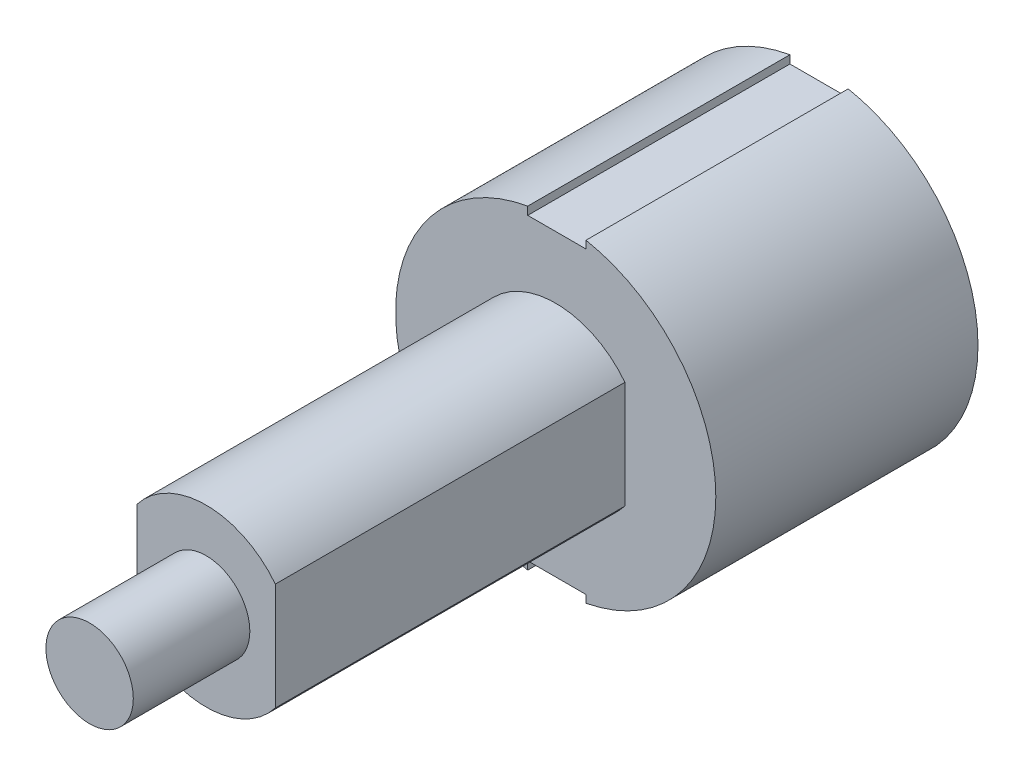
ISO-10303-21;
HEADER;
FILE_DESCRIPTION(('STEP AP214'),'2;1');
FILE_NAME('part.step','',(''),(''),'','','');
FILE_SCHEMA(('AUTOMOTIVE_DESIGN { 1 0 10303 214 1 1 1 1 }'));
ENDSEC;
DATA;
#1=APPLICATION_CONTEXT('core data for automotive mechanical design processes');
#2=APPLICATION_PROTOCOL_DEFINITION('international standard','automotive_design',2000,#1);
#3=PRODUCT_CONTEXT('',#1,'mechanical');
#4=PRODUCT('Part','Part','',(#3));
#5=PRODUCT_RELATED_PRODUCT_CATEGORY('part','',(#4));
#6=PRODUCT_DEFINITION_FORMATION('','',#4);
#7=PRODUCT_DEFINITION_CONTEXT('part definition',#1,'design');
#8=PRODUCT_DEFINITION('design','',#6,#7);
#9=PRODUCT_DEFINITION_SHAPE('','',#8);
#10=(LENGTH_UNIT() NAMED_UNIT(*) SI_UNIT(.MILLI.,.METRE.));
#11=(NAMED_UNIT(*) PLANE_ANGLE_UNIT() SI_UNIT($,.RADIAN.));
#12=(NAMED_UNIT(*) SI_UNIT($,.STERADIAN.) SOLID_ANGLE_UNIT());
#13=UNCERTAINTY_MEASURE_WITH_UNIT(LENGTH_MEASURE(1.E-05),#10,'distance_accuracy_value','');
#14=(GEOMETRIC_REPRESENTATION_CONTEXT(3) GLOBAL_UNCERTAINTY_ASSIGNED_CONTEXT((#13)) GLOBAL_UNIT_ASSIGNED_CONTEXT((#10,
#11,#12)) REPRESENTATION_CONTEXT('',''));
#15=CARTESIAN_POINT('',(0.,0.,0.));
#16=DIRECTION('',(0.,0.,1.));
#17=DIRECTION('',(1.,0.,0.));
#18=AXIS2_PLACEMENT_3D('',#15,#16,#17);
#19=CARTESIAN_POINT('',(1.65099999999998,0.,14.2875));
#20=DIRECTION('',(-1.,0.,0.));
#21=DIRECTION('',(0.,-1.,0.));
#22=AXIS2_PLACEMENT_3D('',#19,#20,#21);
#23=PLANE('',#22);
#24=DIRECTION('',(0.,1.,0.));
#25=VECTOR('',#24,1.);
#26=CARTESIAN_POINT('',(1.65099999999998,0.,0.));
#27=LINE('',#26,#25);
#28=CARTESIAN_POINT('',(1.651,-8.56726788480435,0.));
#29=VERTEX_POINT('',#28);
#30=CARTESIAN_POINT('',(1.651,-8.15270585446612,0.));
#31=VERTEX_POINT('',#30);
#32=EDGE_CURVE('E183',#29,#31,#27,.T.);
#33=ORIENTED_EDGE('',*,*,#32,.F.);
#34=DIRECTION('',(0.,0.,-1.));
#35=VECTOR('',#34,1.);
#36=CARTESIAN_POINT('',(1.651,-8.56726788480435,14.2875));
#37=LINE('',#36,#35);
#38=CARTESIAN_POINT('',(1.651,-8.56726788480435,14.2875));
#39=VERTEX_POINT('',#38);
#40=EDGE_CURVE('E11',#39,#29,#37,.T.);
#41=ORIENTED_EDGE('',*,*,#40,.F.);
#42=DIRECTION('',(0.,1.,0.));
#43=VECTOR('',#42,1.);
#44=CARTESIAN_POINT('',(1.65099999999998,0.,14.2875));
#45=LINE('',#44,#43);
#46=CARTESIAN_POINT('',(1.651,-8.15270585446612,14.2875));
#47=VERTEX_POINT('',#46);
#48=EDGE_CURVE('E219',#39,#47,#45,.T.);
#49=ORIENTED_EDGE('',*,*,#48,.T.);
#50=DIRECTION('',(0.,0.,-1.));
#51=VECTOR('',#50,1.);
#52=CARTESIAN_POINT('',(1.651,-8.15270585446612,14.2875));
#53=LINE('',#52,#51);
#54=EDGE_CURVE('E93',#47,#31,#53,.T.);
#55=ORIENTED_EDGE('',*,*,#54,.T.);
#56=EDGE_LOOP('',(#33,#41,#49,#55));
#57=FACE_BOUND('',#56,.T.);
#58=ADVANCED_FACE('F41',(#57),#23,.T.);
#59=CARTESIAN_POINT('',(0.,0.,14.2875));
#60=DIRECTION('',(0.,0.,-1.));
#61=DIRECTION('',(-1.,0.,0.));
#62=AXIS2_PLACEMENT_3D('',#59,#60,#61);
#63=CYLINDRICAL_SURFACE('',#62,8.7249);
#64=CARTESIAN_POINT('',(0.,0.,0.));
#65=DIRECTION('',(0.,0.,1.));
#66=DIRECTION('',(1.,0.,0.));
#67=AXIS2_PLACEMENT_3D('',#64,#65,#66);
#68=CIRCLE('',#67,8.7249);
#69=CARTESIAN_POINT('',(1.651,8.56726788480435,0.));
#70=VERTEX_POINT('',#69);
#71=EDGE_CURVE('E180',#29,#70,#68,.T.);
#72=ORIENTED_EDGE('',*,*,#71,.T.);
#73=DIRECTION('',(0.,0.,-1.));
#74=VECTOR('',#73,1.);
#75=CARTESIAN_POINT('',(1.651,8.56726788480435,14.2875));
#76=LINE('',#75,#74);
#77=CARTESIAN_POINT('',(1.651,8.56726788480435,14.2875));
#78=VERTEX_POINT('',#77);
#79=EDGE_CURVE('E50',#78,#70,#76,.T.);
#80=ORIENTED_EDGE('',*,*,#79,.F.);
#81=CARTESIAN_POINT('',(0.,0.,14.2875));
#82=DIRECTION('',(0.,0.,1.));
#83=DIRECTION('',(1.,0.,0.));
#84=AXIS2_PLACEMENT_3D('',#81,#82,#83);
#85=CIRCLE('',#84,8.7249);
#86=EDGE_CURVE('E216',#39,#78,#85,.T.);
#87=ORIENTED_EDGE('',*,*,#86,.F.);
#88=ORIENTED_EDGE('',*,*,#40,.T.);
#89=EDGE_LOOP('',(#72,#80,#87,#88));
#90=FACE_BOUND('',#89,.T.);
#91=ADVANCED_FACE('F181',(#90),#63,.T.);
#92=CARTESIAN_POINT('',(1.651,0.,14.2875));
#93=DIRECTION('',(1.,0.,0.));
#94=DIRECTION('',(0.,0.,-1.));
#95=AXIS2_PLACEMENT_3D('',#92,#93,#94);
#96=PLANE('',#95);
#97=DIRECTION('',(0.,-1.,0.));
#98=VECTOR('',#97,1.);
#99=CARTESIAN_POINT('',(1.651,0.,0.));
#100=LINE('',#99,#98);
#101=CARTESIAN_POINT('',(1.651,8.15270585446612,0.));
#102=VERTEX_POINT('',#101);
#103=EDGE_CURVE('E173',#70,#102,#100,.T.);
#104=ORIENTED_EDGE('',*,*,#103,.T.);
#105=DIRECTION('',(0.,0.,-1.));
#106=VECTOR('',#105,1.);
#107=CARTESIAN_POINT('',(1.651,8.15270585446612,14.2875));
#108=LINE('',#107,#106);
#109=CARTESIAN_POINT('',(1.651,8.15270585446612,14.2875));
#110=VERTEX_POINT('',#109);
#111=EDGE_CURVE('E163',#110,#102,#108,.T.);
#112=ORIENTED_EDGE('',*,*,#111,.F.);
#113=DIRECTION('',(0.,-1.,0.));
#114=VECTOR('',#113,1.);
#115=CARTESIAN_POINT('',(1.651,0.,14.2875));
#116=LINE('',#115,#114);
#117=EDGE_CURVE('E175',#78,#110,#116,.T.);
#118=ORIENTED_EDGE('',*,*,#117,.F.);
#119=ORIENTED_EDGE('',*,*,#79,.T.);
#120=EDGE_LOOP('',(#104,#112,#118,#119));
#121=FACE_BOUND('',#120,.T.);
#122=ADVANCED_FACE('F171',(#121),#96,.F.);
#123=CARTESIAN_POINT('',(0.,8.15270585446612,14.2875));
#124=DIRECTION('',(0.,1.,0.));
#125=DIRECTION('',(0.,0.,1.));
#126=AXIS2_PLACEMENT_3D('',#123,#124,#125);
#127=PLANE('',#126);
#128=DIRECTION('',(1.,0.,0.));
#129=VECTOR('',#128,1.);
#130=CARTESIAN_POINT('',(0.,8.15270585446612,0.));
#131=LINE('',#130,#129);
#132=CARTESIAN_POINT('',(-1.524,8.15270585446612,0.));
#133=VERTEX_POINT('',#132);
#134=EDGE_CURVE('E187',#133,#102,#131,.T.);
#135=ORIENTED_EDGE('',*,*,#134,.F.);
#136=DIRECTION('',(0.,0.,-1.));
#137=VECTOR('',#136,1.);
#138=CARTESIAN_POINT('',(-1.524,8.15270585446612,14.2875));
#139=LINE('',#138,#137);
#140=CARTESIAN_POINT('',(-1.524,8.15270585446612,14.2875));
#141=VERTEX_POINT('',#140);
#142=EDGE_CURVE('E156',#141,#133,#139,.T.);
#143=ORIENTED_EDGE('',*,*,#142,.F.);
#144=DIRECTION('',(1.,0.,0.));
#145=VECTOR('',#144,1.);
#146=CARTESIAN_POINT('',(0.,8.15270585446612,14.2875));
#147=LINE('',#146,#145);
#148=EDGE_CURVE('E210',#141,#110,#147,.T.);
#149=ORIENTED_EDGE('',*,*,#148,.T.);
#150=ORIENTED_EDGE('',*,*,#111,.T.);
#151=EDGE_LOOP('',(#135,#143,#149,#150));
#152=FACE_BOUND('',#151,.T.);
#153=ADVANCED_FACE('F314',(#152),#127,.T.);
#154=CARTESIAN_POINT('',(-1.524,0.,14.2875));
#155=DIRECTION('',(1.,0.,0.));
#156=DIRECTION('',(0.,0.,-1.));
#157=AXIS2_PLACEMENT_3D('',#154,#155,#156);
#158=PLANE('',#157);
#159=DIRECTION('',(0.,-1.,0.));
#160=VECTOR('',#159,1.);
#161=CARTESIAN_POINT('',(-1.524,0.,0.));
#162=LINE('',#161,#160);
#163=CARTESIAN_POINT('',(-1.524,8.59076853430472,0.));
#164=VERTEX_POINT('',#163);
#165=EDGE_CURVE('E195',#164,#133,#162,.T.);
#166=ORIENTED_EDGE('',*,*,#165,.F.);
#167=DIRECTION('',(0.,0.,-1.));
#168=VECTOR('',#167,1.);
#169=CARTESIAN_POINT('',(-1.524,8.59076853430472,14.2875));
#170=LINE('',#169,#168);
#171=CARTESIAN_POINT('',(-1.524,8.59076853430472,14.2875));
#172=VERTEX_POINT('',#171);
#173=EDGE_CURVE('E152',#172,#164,#170,.T.);
#174=ORIENTED_EDGE('',*,*,#173,.F.);
#175=DIRECTION('',(0.,-1.,0.));
#176=VECTOR('',#175,1.);
#177=CARTESIAN_POINT('',(-1.524,0.,14.2875));
#178=LINE('',#177,#176);
#179=EDGE_CURVE('E144',#172,#141,#178,.T.);
#180=ORIENTED_EDGE('',*,*,#179,.T.);
#181=ORIENTED_EDGE('',*,*,#142,.T.);
#182=EDGE_LOOP('',(#166,#174,#180,#181));
#183=FACE_BOUND('',#182,.T.);
#184=ADVANCED_FACE('F311',(#183),#158,.T.);
#185=CARTESIAN_POINT('',(0.,0.,14.2875));
#186=DIRECTION('',(0.,0.,-1.));
#187=DIRECTION('',(-1.,0.,0.));
#188=AXIS2_PLACEMENT_3D('',#185,#186,#187);
#189=CYLINDRICAL_SURFACE('',#188,8.7249);
#190=CARTESIAN_POINT('',(0.,0.,0.));
#191=DIRECTION('',(0.,0.,1.));
#192=DIRECTION('',(1.,0.,0.));
#193=AXIS2_PLACEMENT_3D('',#190,#191,#192);
#194=CIRCLE('',#193,8.7249);
#195=CARTESIAN_POINT('',(-1.524,-8.59076853430472,0.));
#196=VERTEX_POINT('',#195);
#197=EDGE_CURVE('E150',#164,#196,#194,.T.);
#198=ORIENTED_EDGE('',*,*,#197,.T.);
#199=DIRECTION('',(0.,0.,-1.));
#200=VECTOR('',#199,1.);
#201=CARTESIAN_POINT('',(-1.524,-8.59076853430472,14.2875));
#202=LINE('',#201,#200);
#203=CARTESIAN_POINT('',(-1.524,-8.59076853430472,14.2875));
#204=VERTEX_POINT('',#203);
#205=EDGE_CURVE('E133',#204,#196,#202,.T.);
#206=ORIENTED_EDGE('',*,*,#205,.F.);
#207=CARTESIAN_POINT('',(0.,0.,14.2875));
#208=DIRECTION('',(0.,0.,1.));
#209=DIRECTION('',(1.,0.,0.));
#210=AXIS2_PLACEMENT_3D('',#207,#208,#209);
#211=CIRCLE('',#210,8.7249);
#212=EDGE_CURVE('E137',#172,#204,#211,.T.);
#213=ORIENTED_EDGE('',*,*,#212,.F.);
#214=ORIENTED_EDGE('',*,*,#173,.T.);
#215=EDGE_LOOP('',(#198,#206,#213,#214));
#216=FACE_BOUND('',#215,.T.);
#217=ADVANCED_FACE('F148',(#216),#189,.T.);
#218=CARTESIAN_POINT('',(-1.52399999999998,0.,14.2875));
#219=DIRECTION('',(-1.,0.,0.));
#220=DIRECTION('',(0.,-1.,0.));
#221=AXIS2_PLACEMENT_3D('',#218,#219,#220);
#222=PLANE('',#221);
#223=DIRECTION('',(0.,1.,0.));
#224=VECTOR('',#223,1.);
#225=CARTESIAN_POINT('',(-1.52399999999998,0.,0.));
#226=LINE('',#225,#224);
#227=CARTESIAN_POINT('',(-1.524,-8.15270585446612,0.));
#228=VERTEX_POINT('',#227);
#229=EDGE_CURVE('E201',#196,#228,#226,.T.);
#230=ORIENTED_EDGE('',*,*,#229,.T.);
#231=DIRECTION('',(0.,0.,-1.));
#232=VECTOR('',#231,1.);
#233=CARTESIAN_POINT('',(-1.524,-8.15270585446612,14.2875));
#234=LINE('',#233,#232);
#235=CARTESIAN_POINT('',(-1.524,-8.15270585446612,14.2875));
#236=VERTEX_POINT('',#235);
#237=EDGE_CURVE('E135',#236,#228,#234,.T.);
#238=ORIENTED_EDGE('',*,*,#237,.F.);
#239=DIRECTION('',(0.,1.,0.));
#240=VECTOR('',#239,1.);
#241=CARTESIAN_POINT('',(-1.52399999999998,0.,14.2875));
#242=LINE('',#241,#240);
#243=EDGE_CURVE('E128',#204,#236,#242,.T.);
#244=ORIENTED_EDGE('',*,*,#243,.F.);
#245=ORIENTED_EDGE('',*,*,#205,.T.);
#246=EDGE_LOOP('',(#230,#238,#244,#245));
#247=FACE_BOUND('',#246,.T.);
#248=ADVANCED_FACE('F131',(#247),#222,.F.);
#249=CARTESIAN_POINT('',(0.,-8.15270585446612,14.2875));
#250=DIRECTION('',(0.,1.,0.));
#251=DIRECTION('',(0.,0.,1.));
#252=AXIS2_PLACEMENT_3D('',#249,#250,#251);
#253=PLANE('',#252);
#254=DIRECTION('',(1.,0.,0.));
#255=VECTOR('',#254,1.);
#256=CARTESIAN_POINT('',(0.,-8.15270585446612,0.));
#257=LINE('',#256,#255);
#258=EDGE_CURVE('E86',#228,#31,#257,.T.);
#259=ORIENTED_EDGE('',*,*,#258,.T.);
#260=ORIENTED_EDGE('',*,*,#54,.F.);
#261=DIRECTION('',(1.,0.,0.));
#262=VECTOR('',#261,1.);
#263=CARTESIAN_POINT('',(0.,-8.15270585446612,14.2875));
#264=LINE('',#263,#262);
#265=EDGE_CURVE('E58',#236,#47,#264,.T.);
#266=ORIENTED_EDGE('',*,*,#265,.F.);
#267=ORIENTED_EDGE('',*,*,#237,.T.);
#268=EDGE_LOOP('',(#259,#260,#266,#267));
#269=FACE_BOUND('',#268,.T.);
#270=ADVANCED_FACE('F301',(#269),#253,.F.);
#271=CARTESIAN_POINT('',(0.,0.,14.2875));
#272=DIRECTION('',(0.,0.,1.));
#273=DIRECTION('',(1.,0.,0.));
#274=AXIS2_PLACEMENT_3D('',#271,#272,#273);
#275=PLANE('',#274);
#276=CARTESIAN_POINT('',(0.,0.,14.2875));
#277=DIRECTION('',(0.,0.,1.));
#278=DIRECTION('',(1.,0.,0.));
#279=AXIS2_PLACEMENT_3D('',#276,#277,#278);
#280=CIRCLE('',#279,4.77012);
#281=CARTESIAN_POINT('',(3.77063,2.92171083742043,14.2875));
#282=VERTEX_POINT('',#281);
#283=CARTESIAN_POINT('',(-3.77063,2.92171083742043,14.2875));
#284=VERTEX_POINT('',#283);
#285=EDGE_CURVE('E101',#282,#284,#280,.T.);
#286=ORIENTED_EDGE('',*,*,#285,.F.);
#287=DIRECTION('',(0.,1.,0.));
#288=VECTOR('',#287,1.);
#289=CARTESIAN_POINT('',(3.77063,0.,14.2875));
#290=LINE('',#289,#288);
#291=CARTESIAN_POINT('',(3.77063,-2.92171083742043,14.2875));
#292=VERTEX_POINT('',#291);
#293=EDGE_CURVE('E229',#292,#282,#290,.T.);
#294=ORIENTED_EDGE('',*,*,#293,.F.);
#295=CARTESIAN_POINT('',(0.,0.,14.2875));
#296=DIRECTION('',(0.,0.,1.));
#297=DIRECTION('',(1.,0.,0.));
#298=AXIS2_PLACEMENT_3D('',#295,#296,#297);
#299=CIRCLE('',#298,4.77012);
#300=CARTESIAN_POINT('',(-3.77063,-2.92171083742043,14.2875));
#301=VERTEX_POINT('',#300);
#302=EDGE_CURVE('E225',#301,#292,#299,.T.);
#303=ORIENTED_EDGE('',*,*,#302,.F.);
#304=DIRECTION('',(0.,1.,0.));
#305=VECTOR('',#304,1.);
#306=CARTESIAN_POINT('',(-3.77063,0.,14.2875));
#307=LINE('',#306,#305);
#308=EDGE_CURVE('E222',#301,#284,#307,.T.);
#309=ORIENTED_EDGE('',*,*,#308,.T.);
#310=EDGE_LOOP('',(#286,#294,#303,#309));
#311=FACE_BOUND('',#310,.T.);
#312=ORIENTED_EDGE('',*,*,#48,.F.);
#313=ORIENTED_EDGE('',*,*,#86,.T.);
#314=ORIENTED_EDGE('',*,*,#117,.T.);
#315=ORIENTED_EDGE('',*,*,#148,.F.);
#316=ORIENTED_EDGE('',*,*,#179,.F.);
#317=ORIENTED_EDGE('',*,*,#212,.T.);
#318=ORIENTED_EDGE('',*,*,#243,.T.);
#319=ORIENTED_EDGE('',*,*,#265,.T.);
#320=EDGE_LOOP('',(#312,#313,#314,#315,#316,#317,#318,#319));
#321=FACE_BOUND('',#320,.T.);
#322=ADVANCED_FACE('F141',(#311,#321),#275,.T.);
#323=CARTESIAN_POINT('',(0.,0.,0.));
#324=DIRECTION('',(0.,0.,1.));
#325=DIRECTION('',(1.,0.,0.));
#326=AXIS2_PLACEMENT_3D('',#323,#324,#325);
#327=PLANE('',#326);
#328=ORIENTED_EDGE('',*,*,#32,.T.);
#329=ORIENTED_EDGE('',*,*,#258,.F.);
#330=ORIENTED_EDGE('',*,*,#229,.F.);
#331=ORIENTED_EDGE('',*,*,#197,.F.);
#332=ORIENTED_EDGE('',*,*,#165,.T.);
#333=ORIENTED_EDGE('',*,*,#134,.T.);
#334=ORIENTED_EDGE('',*,*,#103,.F.);
#335=ORIENTED_EDGE('',*,*,#71,.F.);
#336=EDGE_LOOP('',(#328,#329,#330,#331,#332,#333,#334,#335));
#337=FACE_BOUND('',#336,.T.);
#338=ADVANCED_FACE('F290',(#337),#327,.F.);
#339=CARTESIAN_POINT('',(3.77063,0.,33.3375));
#340=DIRECTION('',(-1.,0.,0.));
#341=DIRECTION('',(0.,0.,1.));
#342=AXIS2_PLACEMENT_3D('',#339,#340,#341);
#343=PLANE('',#342);
#344=ORIENTED_EDGE('',*,*,#293,.T.);
#345=DIRECTION('',(0.,0.,-1.));
#346=VECTOR('',#345,1.);
#347=CARTESIAN_POINT('',(3.77063,2.92171083742043,33.3375));
#348=LINE('',#347,#346);
#349=CARTESIAN_POINT('',(3.77063,2.92171083742043,33.3375));
#350=VERTEX_POINT('',#349);
#351=EDGE_CURVE('E189',#350,#282,#348,.T.);
#352=ORIENTED_EDGE('',*,*,#351,.F.);
#353=DIRECTION('',(0.,1.,0.));
#354=VECTOR('',#353,1.);
#355=CARTESIAN_POINT('',(3.77063,0.,33.3375));
#356=LINE('',#355,#354);
#357=CARTESIAN_POINT('',(3.77063,-2.92171083742043,33.3375));
#358=VERTEX_POINT('',#357);
#359=EDGE_CURVE('E261',#358,#350,#356,.T.);
#360=ORIENTED_EDGE('',*,*,#359,.F.);
#361=DIRECTION('',(0.,0.,-1.));
#362=VECTOR('',#361,1.);
#363=CARTESIAN_POINT('',(3.77063,-2.92171083742043,33.3375));
#364=LINE('',#363,#362);
#365=EDGE_CURVE('E245',#358,#292,#364,.T.);
#366=ORIENTED_EDGE('',*,*,#365,.T.);
#367=EDGE_LOOP('',(#344,#352,#360,#366));
#368=FACE_BOUND('',#367,.T.);
#369=ADVANCED_FACE('F292',(#368),#343,.F.);
#370=CARTESIAN_POINT('',(0.,0.,33.3375));
#371=DIRECTION('',(0.,0.,-1.));
#372=DIRECTION('',(-1.,0.,0.));
#373=AXIS2_PLACEMENT_3D('',#370,#371,#372);
#374=CYLINDRICAL_SURFACE('',#373,4.77012);
#375=ORIENTED_EDGE('',*,*,#285,.T.);
#376=DIRECTION('',(0.,0.,-1.));
#377=VECTOR('',#376,1.);
#378=CARTESIAN_POINT('',(-3.77063,2.92171083742043,33.3375));
#379=LINE('',#378,#377);
#380=CARTESIAN_POINT('',(-3.77063,2.92171083742043,33.3375));
#381=VERTEX_POINT('',#380);
#382=EDGE_CURVE('E237',#381,#284,#379,.T.);
#383=ORIENTED_EDGE('',*,*,#382,.F.);
#384=CARTESIAN_POINT('',(0.,0.,33.3375));
#385=DIRECTION('',(0.,0.,1.));
#386=DIRECTION('',(1.,0.,0.));
#387=AXIS2_PLACEMENT_3D('',#384,#385,#386);
#388=CIRCLE('',#387,4.77012);
#389=EDGE_CURVE('E257',#350,#381,#388,.T.);
#390=ORIENTED_EDGE('',*,*,#389,.F.);
#391=ORIENTED_EDGE('',*,*,#351,.T.);
#392=EDGE_LOOP('',(#375,#383,#390,#391));
#393=FACE_BOUND('',#392,.T.);
#394=ADVANCED_FACE('F298',(#393),#374,.T.);
#395=CARTESIAN_POINT('',(-3.77063,0.,33.3375));
#396=DIRECTION('',(-1.,0.,0.));
#397=DIRECTION('',(0.,0.,1.));
#398=AXIS2_PLACEMENT_3D('',#395,#396,#397);
#399=PLANE('',#398);
#400=ORIENTED_EDGE('',*,*,#382,.T.);
#401=ORIENTED_EDGE('',*,*,#308,.F.);
#402=DIRECTION('',(0.,0.,-1.));
#403=VECTOR('',#402,1.);
#404=CARTESIAN_POINT('',(-3.77063,-2.92171083742043,33.3375));
#405=LINE('',#404,#403);
#406=CARTESIAN_POINT('',(-3.77063,-2.92171083742043,33.3375));
#407=VERTEX_POINT('',#406);
#408=EDGE_CURVE('E241',#407,#301,#405,.T.);
#409=ORIENTED_EDGE('',*,*,#408,.F.);
#410=DIRECTION('',(0.,1.,0.));
#411=VECTOR('',#410,1.);
#412=CARTESIAN_POINT('',(-3.77063,0.,33.3375));
#413=LINE('',#412,#411);
#414=EDGE_CURVE('E253',#407,#381,#413,.T.);
#415=ORIENTED_EDGE('',*,*,#414,.T.);
#416=EDGE_LOOP('',(#400,#401,#409,#415));
#417=FACE_BOUND('',#416,.T.);
#418=ADVANCED_FACE('F365',(#417),#399,.T.);
#419=CARTESIAN_POINT('',(0.,0.,33.3375));
#420=DIRECTION('',(0.,0.,-1.));
#421=DIRECTION('',(-1.,0.,0.));
#422=AXIS2_PLACEMENT_3D('',#419,#420,#421);
#423=CYLINDRICAL_SURFACE('',#422,4.77012);
#424=ORIENTED_EDGE('',*,*,#302,.T.);
#425=ORIENTED_EDGE('',*,*,#365,.F.);
#426=CARTESIAN_POINT('',(0.,0.,33.3375));
#427=DIRECTION('',(0.,0.,1.));
#428=DIRECTION('',(1.,0.,0.));
#429=AXIS2_PLACEMENT_3D('',#426,#427,#428);
#430=CIRCLE('',#429,4.77012);
#431=EDGE_CURVE('E249',#407,#358,#430,.T.);
#432=ORIENTED_EDGE('',*,*,#431,.F.);
#433=ORIENTED_EDGE('',*,*,#408,.T.);
#434=EDGE_LOOP('',(#424,#425,#432,#433));
#435=FACE_BOUND('',#434,.T.);
#436=ADVANCED_FACE('F375',(#435),#423,.T.);
#437=CARTESIAN_POINT('',(0.,0.,33.3375));
#438=DIRECTION('',(0.,0.,1.));
#439=DIRECTION('',(1.,0.,0.));
#440=AXIS2_PLACEMENT_3D('',#437,#438,#439);
#441=PLANE('',#440);
#442=CARTESIAN_POINT('',(0.,0.,33.3375));
#443=DIRECTION('',(0.,0.,1.));
#444=DIRECTION('',(1.,0.,0.));
#445=AXIS2_PLACEMENT_3D('',#442,#443,#444);
#446=CIRCLE('',#445,2.38125);
#447=CARTESIAN_POINT('',(2.38125,0.,33.3375));
#448=VERTEX_POINT('',#447);
#449=EDGE_CURVE('E265',#448,#448,#446,.T.);
#450=ORIENTED_EDGE('',*,*,#449,.F.);
#451=EDGE_LOOP('',(#450));
#452=FACE_BOUND('',#451,.T.);
#453=ORIENTED_EDGE('',*,*,#359,.T.);
#454=ORIENTED_EDGE('',*,*,#389,.T.);
#455=ORIENTED_EDGE('',*,*,#414,.F.);
#456=ORIENTED_EDGE('',*,*,#431,.T.);
#457=EDGE_LOOP('',(#453,#454,#455,#456));
#458=FACE_BOUND('',#457,.T.);
#459=ADVANCED_FACE('F283',(#452,#458),#441,.T.);
#460=CARTESIAN_POINT('',(0.,0.,39.6875));
#461=DIRECTION('',(0.,0.,1.));
#462=DIRECTION('',(1.,0.,0.));
#463=AXIS2_PLACEMENT_3D('',#460,#461,#462);
#464=PLANE('',#463);
#465=CARTESIAN_POINT('',(0.,0.,39.6875));
#466=DIRECTION('',(0.,0.,1.));
#467=DIRECTION('',(1.,0.,0.));
#468=AXIS2_PLACEMENT_3D('',#465,#466,#467);
#469=CIRCLE('',#468,2.38125);
#470=CARTESIAN_POINT('',(2.38125,0.,39.6875));
#471=VERTEX_POINT('',#470);
#472=EDGE_CURVE('E269',#471,#471,#469,.T.);
#473=ORIENTED_EDGE('',*,*,#472,.T.);
#474=EDGE_LOOP('',(#473));
#475=FACE_BOUND('',#474,.T.);
#476=ADVANCED_FACE('F274',(#475),#464,.T.);
#477=CARTESIAN_POINT('',(0.,0.,39.6875));
#478=DIRECTION('',(0.,0.,-1.));
#479=DIRECTION('',(-1.,0.,0.));
#480=AXIS2_PLACEMENT_3D('',#477,#478,#479);
#481=CYLINDRICAL_SURFACE('',#480,2.38125);
#482=ORIENTED_EDGE('',*,*,#449,.T.);
#483=EDGE_LOOP('',(#482));
#484=FACE_BOUND('',#483,.T.);
#485=ORIENTED_EDGE('',*,*,#472,.F.);
#486=EDGE_LOOP('',(#485));
#487=FACE_BOUND('',#486,.T.);
#488=ADVANCED_FACE('F276',(#484,#487),#481,.T.);
#489=CLOSED_SHELL('',(#58,#91,#122,#153,#184,#217,#248,#270,#322,#338,#369,#394,#418,#436,#459,
#476,#488));
#490=MANIFOLD_SOLID_BREP('B2',#489);
#491=ADVANCED_BREP_SHAPE_REPRESENTATION('',(#18,#490),#14);
#492=SHAPE_DEFINITION_REPRESENTATION(#9,#491);
ENDSEC;
END-ISO-10303-21;
